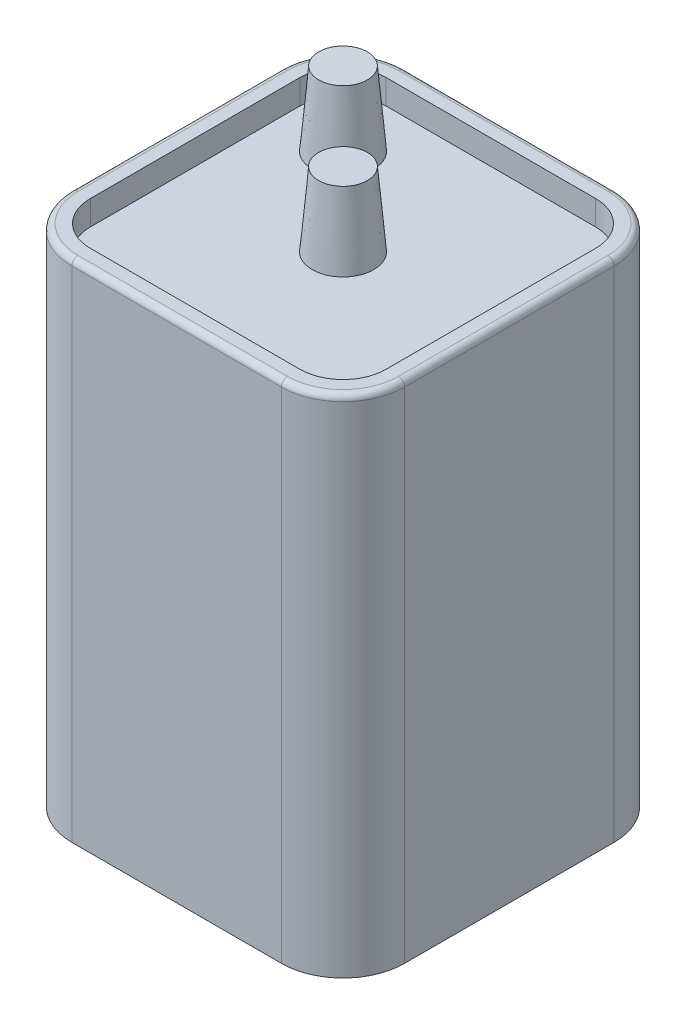
ISO-10303-21;
HEADER;
FILE_DESCRIPTION(('STEP AP214'),'2;1');
FILE_NAME('part.step','',(''),(''),'','','');
FILE_SCHEMA(('AUTOMOTIVE_DESIGN { 1 0 10303 214 1 1 1 1 }'));
ENDSEC;
DATA;
#1=APPLICATION_CONTEXT('core data for automotive mechanical design processes');
#2=APPLICATION_PROTOCOL_DEFINITION('international standard','automotive_design',2000,#1);
#3=PRODUCT_CONTEXT('',#1,'mechanical');
#4=PRODUCT('Part','Part','',(#3));
#5=PRODUCT_RELATED_PRODUCT_CATEGORY('part','',(#4));
#6=PRODUCT_DEFINITION_FORMATION('','',#4);
#7=PRODUCT_DEFINITION_CONTEXT('part definition',#1,'design');
#8=PRODUCT_DEFINITION('design','',#6,#7);
#9=PRODUCT_DEFINITION_SHAPE('','',#8);
#10=(LENGTH_UNIT() NAMED_UNIT(*) SI_UNIT(.MILLI.,.METRE.));
#11=(NAMED_UNIT(*) PLANE_ANGLE_UNIT() SI_UNIT($,.RADIAN.));
#12=(NAMED_UNIT(*) SI_UNIT($,.STERADIAN.) SOLID_ANGLE_UNIT());
#13=UNCERTAINTY_MEASURE_WITH_UNIT(LENGTH_MEASURE(1.E-05),#10,'distance_accuracy_value','');
#14=(GEOMETRIC_REPRESENTATION_CONTEXT(3) GLOBAL_UNCERTAINTY_ASSIGNED_CONTEXT((#13)) GLOBAL_UNIT_ASSIGNED_CONTEXT((#10,
#11,#12)) REPRESENTATION_CONTEXT('',''));
#15=CARTESIAN_POINT('',(0.,0.,0.));
#16=DIRECTION('',(0.,0.,1.));
#17=DIRECTION('',(1.,0.,0.));
#18=AXIS2_PLACEMENT_3D('',#15,#16,#17);
#19=CARTESIAN_POINT('',(34.29,104.14,34.29));
#20=DIRECTION('',(-1.,0.,0.));
#21=DIRECTION('',(0.,0.,1.));
#22=AXIS2_PLACEMENT_3D('',#19,#20,#21);
#23=PLANE('',#22);
#24=DIRECTION('',(0.,-1.,0.));
#25=VECTOR('',#24,1.);
#26=CARTESIAN_POINT('',(34.29,104.14,-21.59));
#27=LINE('',#26,#25);
#28=CARTESIAN_POINT('',(34.29,0.,-21.59));
#29=VERTEX_POINT('',#28);
#30=CARTESIAN_POINT('',(34.29,102.87,-21.59));
#31=VERTEX_POINT('',#30);
#32=EDGE_CURVE('E291',#29,#31,#27,.F.);
#33=ORIENTED_EDGE('',*,*,#32,.T.);
#34=DIRECTION('',(0.,0.,-1.));
#35=VECTOR('',#34,1.);
#36=CARTESIAN_POINT('',(34.29,102.87,34.29));
#37=LINE('',#36,#35);
#38=CARTESIAN_POINT('',(34.29,102.87,21.59));
#39=VERTEX_POINT('',#38);
#40=EDGE_CURVE('E314',#31,#39,#37,.F.);
#41=ORIENTED_EDGE('',*,*,#40,.T.);
#42=DIRECTION('',(0.,-1.,0.));
#43=VECTOR('',#42,1.);
#44=CARTESIAN_POINT('',(34.29,104.14,21.59));
#45=LINE('',#44,#43);
#46=CARTESIAN_POINT('',(34.29,0.,21.59));
#47=VERTEX_POINT('',#46);
#48=EDGE_CURVE('E289',#39,#47,#45,.T.);
#49=ORIENTED_EDGE('',*,*,#48,.T.);
#50=DIRECTION('',(0.,0.,-1.));
#51=VECTOR('',#50,1.);
#52=CARTESIAN_POINT('',(34.29,0.,34.29));
#53=LINE('',#52,#51);
#54=EDGE_CURVE('E245',#47,#29,#53,.T.);
#55=ORIENTED_EDGE('',*,*,#54,.T.);
#56=EDGE_LOOP('',(#33,#41,#49,#55));
#57=FACE_BOUND('',#56,.T.);
#58=ADVANCED_FACE('F40',(#57),#23,.F.);
#59=CARTESIAN_POINT('',(-34.29,104.14,-34.29));
#60=DIRECTION('',(0.,0.,1.));
#61=DIRECTION('',(1.,0.,0.));
#62=AXIS2_PLACEMENT_3D('',#59,#60,#61);
#63=PLANE('',#62);
#64=DIRECTION('',(0.,-1.,0.));
#65=VECTOR('',#64,1.);
#66=CARTESIAN_POINT('',(-21.59,104.14,-34.29));
#67=LINE('',#66,#65);
#68=CARTESIAN_POINT('',(-21.59,0.,-34.29));
#69=VERTEX_POINT('',#68);
#70=CARTESIAN_POINT('',(-21.59,102.87,-34.29));
#71=VERTEX_POINT('',#70);
#72=EDGE_CURVE('E287',#69,#71,#67,.F.);
#73=ORIENTED_EDGE('',*,*,#72,.T.);
#74=DIRECTION('',(-1.,0.,0.));
#75=VECTOR('',#74,1.);
#76=CARTESIAN_POINT('',(-34.29,102.87,-34.29));
#77=LINE('',#76,#75);
#78=CARTESIAN_POINT('',(21.59,102.87,-34.29));
#79=VERTEX_POINT('',#78);
#80=EDGE_CURVE('E11',#71,#79,#77,.F.);
#81=ORIENTED_EDGE('',*,*,#80,.T.);
#82=DIRECTION('',(0.,-1.,0.));
#83=VECTOR('',#82,1.);
#84=CARTESIAN_POINT('',(21.59,104.14,-34.29));
#85=LINE('',#84,#83);
#86=CARTESIAN_POINT('',(21.59,0.,-34.29));
#87=VERTEX_POINT('',#86);
#88=EDGE_CURVE('E285',#79,#87,#85,.T.);
#89=ORIENTED_EDGE('',*,*,#88,.T.);
#90=DIRECTION('',(-1.,0.,0.));
#91=VECTOR('',#90,1.);
#92=CARTESIAN_POINT('',(-34.29,0.,-34.29));
#93=LINE('',#92,#91);
#94=EDGE_CURVE('E259',#87,#69,#93,.T.);
#95=ORIENTED_EDGE('',*,*,#94,.T.);
#96=EDGE_LOOP('',(#73,#81,#89,#95));
#97=FACE_BOUND('',#96,.T.);
#98=ADVANCED_FACE('F401',(#97),#63,.F.);
#99=CARTESIAN_POINT('',(-34.29,104.14,34.29));
#100=DIRECTION('',(1.,0.,0.));
#101=DIRECTION('',(0.,0.,-1.));
#102=AXIS2_PLACEMENT_3D('',#99,#100,#101);
#103=PLANE('',#102);
#104=DIRECTION('',(0.,-1.,0.));
#105=VECTOR('',#104,1.);
#106=CARTESIAN_POINT('',(-34.29,104.14,21.59));
#107=LINE('',#106,#105);
#108=CARTESIAN_POINT('',(-34.29,0.,21.59));
#109=VERTEX_POINT('',#108);
#110=CARTESIAN_POINT('',(-34.29,102.87,21.59));
#111=VERTEX_POINT('',#110);
#112=EDGE_CURVE('E283',#109,#111,#107,.F.);
#113=ORIENTED_EDGE('',*,*,#112,.T.);
#114=DIRECTION('',(0.,0.,1.));
#115=VECTOR('',#114,1.);
#116=CARTESIAN_POINT('',(-34.29,102.87,34.29));
#117=LINE('',#116,#115);
#118=CARTESIAN_POINT('',(-34.29,102.87,-21.59));
#119=VERTEX_POINT('',#118);
#120=EDGE_CURVE('E64',#111,#119,#117,.F.);
#121=ORIENTED_EDGE('',*,*,#120,.T.);
#122=DIRECTION('',(0.,-1.,0.));
#123=VECTOR('',#122,1.);
#124=CARTESIAN_POINT('',(-34.29,104.14,-21.59));
#125=LINE('',#124,#123);
#126=CARTESIAN_POINT('',(-34.29,0.,-21.59));
#127=VERTEX_POINT('',#126);
#128=EDGE_CURVE('E281',#119,#127,#125,.T.);
#129=ORIENTED_EDGE('',*,*,#128,.T.);
#130=DIRECTION('',(0.,0.,1.));
#131=VECTOR('',#130,1.);
#132=CARTESIAN_POINT('',(-34.29,0.,34.29));
#133=LINE('',#132,#131);
#134=EDGE_CURVE('E262',#127,#109,#133,.T.);
#135=ORIENTED_EDGE('',*,*,#134,.T.);
#136=EDGE_LOOP('',(#113,#121,#129,#135));
#137=FACE_BOUND('',#136,.T.);
#138=ADVANCED_FACE('F359',(#137),#103,.F.);
#139=CARTESIAN_POINT('',(-34.29,104.14,34.29));
#140=DIRECTION('',(0.,0.,-1.));
#141=DIRECTION('',(-1.,0.,0.));
#142=AXIS2_PLACEMENT_3D('',#139,#140,#141);
#143=PLANE('',#142);
#144=DIRECTION('',(0.,-1.,0.));
#145=VECTOR('',#144,1.);
#146=CARTESIAN_POINT('',(21.59,104.14,34.29));
#147=LINE('',#146,#145);
#148=CARTESIAN_POINT('',(21.59,0.,34.29));
#149=VERTEX_POINT('',#148);
#150=CARTESIAN_POINT('',(21.59,102.87,34.29));
#151=VERTEX_POINT('',#150);
#152=EDGE_CURVE('E268',#149,#151,#147,.F.);
#153=ORIENTED_EDGE('',*,*,#152,.T.);
#154=DIRECTION('',(1.,0.,0.));
#155=VECTOR('',#154,1.);
#156=CARTESIAN_POINT('',(-34.29,102.87,34.29));
#157=LINE('',#156,#155);
#158=CARTESIAN_POINT('',(-21.59,102.87,34.29));
#159=VERTEX_POINT('',#158);
#160=EDGE_CURVE('E318',#151,#159,#157,.F.);
#161=ORIENTED_EDGE('',*,*,#160,.T.);
#162=DIRECTION('',(0.,-1.,0.));
#163=VECTOR('',#162,1.);
#164=CARTESIAN_POINT('',(-21.59,104.14,34.29));
#165=LINE('',#164,#163);
#166=CARTESIAN_POINT('',(-21.59,0.,34.29));
#167=VERTEX_POINT('',#166);
#168=EDGE_CURVE('E271',#159,#167,#165,.T.);
#169=ORIENTED_EDGE('',*,*,#168,.T.);
#170=DIRECTION('',(1.,0.,0.));
#171=VECTOR('',#170,1.);
#172=CARTESIAN_POINT('',(-34.29,0.,34.29));
#173=LINE('',#172,#171);
#174=EDGE_CURVE('E265',#167,#149,#173,.T.);
#175=ORIENTED_EDGE('',*,*,#174,.T.);
#176=EDGE_LOOP('',(#153,#161,#169,#175));
#177=FACE_BOUND('',#176,.T.);
#178=ADVANCED_FACE('F370',(#177),#143,.F.);
#179=CARTESIAN_POINT('',(0.,104.14,0.));
#180=DIRECTION('',(0.,-1.,0.));
#181=DIRECTION('',(0.,0.,-1.));
#182=AXIS2_PLACEMENT_3D('',#179,#180,#181);
#183=PLANE('',#182);
#184=DIRECTION('',(0.,0.,-1.));
#185=VECTOR('',#184,1.);
#186=CARTESIAN_POINT('',(33.02,104.14,0.));
#187=LINE('',#186,#185);
#188=CARTESIAN_POINT('',(33.02,104.14,21.59));
#189=VERTEX_POINT('',#188);
#190=CARTESIAN_POINT('',(33.02,104.14,-21.59));
#191=VERTEX_POINT('',#190);
#192=EDGE_CURVE('E306',#189,#191,#187,.T.);
#193=ORIENTED_EDGE('',*,*,#192,.T.);
#194=CARTESIAN_POINT('',(21.59,104.14,-21.59));
#195=DIRECTION('',(0.,-1.,0.));
#196=DIRECTION('',(0.,0.,-1.));
#197=AXIS2_PLACEMENT_3D('',#194,#195,#196);
#198=CIRCLE('',#197,11.43);
#199=CARTESIAN_POINT('',(21.59,104.14,-33.02));
#200=VERTEX_POINT('',#199);
#201=EDGE_CURVE('E308',#191,#200,#198,.F.);
#202=ORIENTED_EDGE('',*,*,#201,.T.);
#203=DIRECTION('',(-1.,0.,0.));
#204=VECTOR('',#203,1.);
#205=CARTESIAN_POINT('',(0.,104.14,-33.02));
#206=LINE('',#205,#204);
#207=CARTESIAN_POINT('',(-21.59,104.14,-33.02));
#208=VERTEX_POINT('',#207);
#209=EDGE_CURVE('E294',#200,#208,#206,.T.);
#210=ORIENTED_EDGE('',*,*,#209,.T.);
#211=CARTESIAN_POINT('',(-21.59,104.14,-21.59));
#212=DIRECTION('',(0.,-1.,0.));
#213=DIRECTION('',(0.,0.,-1.));
#214=AXIS2_PLACEMENT_3D('',#211,#212,#213);
#215=CIRCLE('',#214,11.43);
#216=CARTESIAN_POINT('',(-33.02,104.14,-21.59));
#217=VERTEX_POINT('',#216);
#218=EDGE_CURVE('E296',#208,#217,#215,.F.);
#219=ORIENTED_EDGE('',*,*,#218,.T.);
#220=DIRECTION('',(0.,0.,1.));
#221=VECTOR('',#220,1.);
#222=CARTESIAN_POINT('',(-33.02,104.14,0.));
#223=LINE('',#222,#221);
#224=CARTESIAN_POINT('',(-33.02,104.14,21.59));
#225=VERTEX_POINT('',#224);
#226=EDGE_CURVE('E298',#217,#225,#223,.T.);
#227=ORIENTED_EDGE('',*,*,#226,.T.);
#228=CARTESIAN_POINT('',(-21.59,104.14,21.59));
#229=DIRECTION('',(0.,-1.,0.));
#230=DIRECTION('',(0.,0.,-1.));
#231=AXIS2_PLACEMENT_3D('',#228,#229,#230);
#232=CIRCLE('',#231,11.43);
#233=CARTESIAN_POINT('',(-21.59,104.14,33.02));
#234=VERTEX_POINT('',#233);
#235=EDGE_CURVE('E300',#225,#234,#232,.F.);
#236=ORIENTED_EDGE('',*,*,#235,.T.);
#237=DIRECTION('',(1.,0.,0.));
#238=VECTOR('',#237,1.);
#239=CARTESIAN_POINT('',(0.,104.14,33.02));
#240=LINE('',#239,#238);
#241=CARTESIAN_POINT('',(21.59,104.14,33.02));
#242=VERTEX_POINT('',#241);
#243=EDGE_CURVE('E302',#234,#242,#240,.T.);
#244=ORIENTED_EDGE('',*,*,#243,.T.);
#245=CARTESIAN_POINT('',(21.59,104.14,21.59));
#246=DIRECTION('',(0.,-1.,0.));
#247=DIRECTION('',(0.,0.,-1.));
#248=AXIS2_PLACEMENT_3D('',#245,#246,#247);
#249=CIRCLE('',#248,11.43);
#250=EDGE_CURVE('E304',#242,#189,#249,.F.);
#251=ORIENTED_EDGE('',*,*,#250,.T.);
#252=EDGE_LOOP('',(#193,#202,#210,#219,#227,#236,#244,#251));
#253=FACE_BOUND('',#252,.T.);
#254=DIRECTION('',(0.,0.,1.));
#255=VECTOR('',#254,1.);
#256=CARTESIAN_POINT('',(-30.48,104.14,-21.59));
#257=LINE('',#256,#255);
#258=CARTESIAN_POINT('',(-30.48,104.14,-21.59));
#259=VERTEX_POINT('',#258);
#260=CARTESIAN_POINT('',(-30.48,104.14,21.59));
#261=VERTEX_POINT('',#260);
#262=EDGE_CURVE('E227',#259,#261,#257,.T.);
#263=ORIENTED_EDGE('',*,*,#262,.F.);
#264=CARTESIAN_POINT('',(-21.59,104.14,-21.59));
#265=DIRECTION('',(0.,1.,0.));
#266=DIRECTION('',(0.,0.,1.));
#267=AXIS2_PLACEMENT_3D('',#264,#265,#266);
#268=CIRCLE('',#267,8.89);
#269=CARTESIAN_POINT('',(-21.59,104.14,-30.48));
#270=VERTEX_POINT('',#269);
#271=EDGE_CURVE('E186',#270,#259,#268,.T.);
#272=ORIENTED_EDGE('',*,*,#271,.F.);
#273=DIRECTION('',(-1.,0.,0.));
#274=VECTOR('',#273,1.);
#275=CARTESIAN_POINT('',(21.59,104.14,-30.48));
#276=LINE('',#275,#274);
#277=CARTESIAN_POINT('',(21.59,104.14,-30.48));
#278=VERTEX_POINT('',#277);
#279=EDGE_CURVE('E204',#278,#270,#276,.T.);
#280=ORIENTED_EDGE('',*,*,#279,.F.);
#281=CARTESIAN_POINT('',(21.59,104.14,-21.59));
#282=DIRECTION('',(0.,1.,0.));
#283=DIRECTION('',(0.,0.,1.));
#284=AXIS2_PLACEMENT_3D('',#281,#282,#283);
#285=CIRCLE('',#284,8.89);
#286=CARTESIAN_POINT('',(30.48,104.14,-21.59));
#287=VERTEX_POINT('',#286);
#288=EDGE_CURVE('E207',#287,#278,#285,.T.);
#289=ORIENTED_EDGE('',*,*,#288,.F.);
#290=DIRECTION('',(0.,0.,-1.));
#291=VECTOR('',#290,1.);
#292=CARTESIAN_POINT('',(30.48,104.14,21.59));
#293=LINE('',#292,#291);
#294=CARTESIAN_POINT('',(30.48,104.14,21.59));
#295=VERTEX_POINT('',#294);
#296=EDGE_CURVE('E238',#295,#287,#293,.T.);
#297=ORIENTED_EDGE('',*,*,#296,.F.);
#298=CARTESIAN_POINT('',(21.59,104.14,21.59));
#299=DIRECTION('',(0.,1.,0.));
#300=DIRECTION('',(0.,0.,1.));
#301=AXIS2_PLACEMENT_3D('',#298,#299,#300);
#302=CIRCLE('',#301,8.89);
#303=CARTESIAN_POINT('',(21.59,104.14,30.48));
#304=VERTEX_POINT('',#303);
#305=EDGE_CURVE('E235',#304,#295,#302,.T.);
#306=ORIENTED_EDGE('',*,*,#305,.F.);
#307=DIRECTION('',(1.,0.,0.));
#308=VECTOR('',#307,1.);
#309=CARTESIAN_POINT('',(-21.59,104.14,30.48));
#310=LINE('',#309,#308);
#311=CARTESIAN_POINT('',(-21.59,104.14,30.48));
#312=VERTEX_POINT('',#311);
#313=EDGE_CURVE('E232',#312,#304,#310,.T.);
#314=ORIENTED_EDGE('',*,*,#313,.F.);
#315=CARTESIAN_POINT('',(-21.59,104.14,21.59));
#316=DIRECTION('',(0.,1.,0.));
#317=DIRECTION('',(0.,0.,1.));
#318=AXIS2_PLACEMENT_3D('',#315,#316,#317);
#319=CIRCLE('',#318,8.89);
#320=EDGE_CURVE('E229',#261,#312,#319,.T.);
#321=ORIENTED_EDGE('',*,*,#320,.F.);
#322=EDGE_LOOP('',(#263,#272,#280,#289,#297,#306,#314,#321));
#323=FACE_BOUND('',#322,.T.);
#324=ADVANCED_FACE('F386',(#253,#323),#183,.F.);
#325=CARTESIAN_POINT('',(0.,0.,0.));
#326=DIRECTION('',(0.,-1.,0.));
#327=DIRECTION('',(0.,0.,-1.));
#328=AXIS2_PLACEMENT_3D('',#325,#326,#327);
#329=PLANE('',#328);
#330=ORIENTED_EDGE('',*,*,#174,.F.);
#331=CARTESIAN_POINT('',(-21.59,0.,21.59));
#332=DIRECTION('',(0.,-1.,0.));
#333=DIRECTION('',(0.,0.,-1.));
#334=AXIS2_PLACEMENT_3D('',#331,#332,#333);
#335=CIRCLE('',#334,12.7);
#336=EDGE_CURVE('E279',#167,#109,#335,.T.);
#337=ORIENTED_EDGE('',*,*,#336,.T.);
#338=ORIENTED_EDGE('',*,*,#134,.F.);
#339=CARTESIAN_POINT('',(-21.59,0.,-21.59));
#340=DIRECTION('',(0.,-1.,0.));
#341=DIRECTION('',(0.,0.,-1.));
#342=AXIS2_PLACEMENT_3D('',#339,#340,#341);
#343=CIRCLE('',#342,12.7);
#344=EDGE_CURVE('E277',#127,#69,#343,.T.);
#345=ORIENTED_EDGE('',*,*,#344,.T.);
#346=ORIENTED_EDGE('',*,*,#94,.F.);
#347=CARTESIAN_POINT('',(21.59,0.,-21.59));
#348=DIRECTION('',(0.,-1.,0.));
#349=DIRECTION('',(0.,0.,-1.));
#350=AXIS2_PLACEMENT_3D('',#347,#348,#349);
#351=CIRCLE('',#350,12.7);
#352=EDGE_CURVE('E275',#87,#29,#351,.T.);
#353=ORIENTED_EDGE('',*,*,#352,.T.);
#354=ORIENTED_EDGE('',*,*,#54,.F.);
#355=CARTESIAN_POINT('',(21.59,0.,21.59));
#356=DIRECTION('',(0.,-1.,0.));
#357=DIRECTION('',(0.,0.,-1.));
#358=AXIS2_PLACEMENT_3D('',#355,#356,#357);
#359=CIRCLE('',#358,12.7);
#360=EDGE_CURVE('E273',#47,#149,#359,.T.);
#361=ORIENTED_EDGE('',*,*,#360,.T.);
#362=EDGE_LOOP('',(#330,#337,#338,#345,#346,#353,#354,#361));
#363=FACE_BOUND('',#362,.T.);
#364=ADVANCED_FACE('F364',(#363),#329,.T.);
#365=CARTESIAN_POINT('',(-21.59,104.14,21.59));
#366=DIRECTION('',(0.,-1.,0.));
#367=DIRECTION('',(0.,0.,-1.));
#368=AXIS2_PLACEMENT_3D('',#365,#366,#367);
#369=CYLINDRICAL_SURFACE('',#368,12.7);
#370=ORIENTED_EDGE('',*,*,#168,.F.);
#371=CARTESIAN_POINT('',(-21.59,102.87,21.59));
#372=DIRECTION('',(0.,-1.,0.));
#373=DIRECTION('',(0.,0.,-1.));
#374=AXIS2_PLACEMENT_3D('',#371,#372,#373);
#375=CIRCLE('',#374,12.7);
#376=EDGE_CURVE('E320',#159,#111,#375,.T.);
#377=ORIENTED_EDGE('',*,*,#376,.T.);
#378=ORIENTED_EDGE('',*,*,#112,.F.);
#379=ORIENTED_EDGE('',*,*,#336,.F.);
#380=EDGE_LOOP('',(#370,#377,#378,#379));
#381=FACE_BOUND('',#380,.T.);
#382=ADVANCED_FACE('F357',(#381),#369,.T.);
#383=CARTESIAN_POINT('',(-21.59,104.14,-21.59));
#384=DIRECTION('',(0.,-1.,0.));
#385=DIRECTION('',(0.,0.,-1.));
#386=AXIS2_PLACEMENT_3D('',#383,#384,#385);
#387=CYLINDRICAL_SURFACE('',#386,12.7);
#388=ORIENTED_EDGE('',*,*,#128,.F.);
#389=CARTESIAN_POINT('',(-21.59,102.87,-21.59));
#390=DIRECTION('',(0.,-1.,0.));
#391=DIRECTION('',(0.,0.,-1.));
#392=AXIS2_PLACEMENT_3D('',#389,#390,#391);
#393=CIRCLE('',#392,12.7);
#394=EDGE_CURVE('E49',#119,#71,#393,.T.);
#395=ORIENTED_EDGE('',*,*,#394,.T.);
#396=ORIENTED_EDGE('',*,*,#72,.F.);
#397=ORIENTED_EDGE('',*,*,#344,.F.);
#398=EDGE_LOOP('',(#388,#395,#396,#397));
#399=FACE_BOUND('',#398,.T.);
#400=ADVANCED_FACE('F432',(#399),#387,.T.);
#401=CARTESIAN_POINT('',(21.59,104.14,-21.59));
#402=DIRECTION('',(0.,-1.,0.));
#403=DIRECTION('',(0.,0.,-1.));
#404=AXIS2_PLACEMENT_3D('',#401,#402,#403);
#405=CYLINDRICAL_SURFACE('',#404,12.7);
#406=ORIENTED_EDGE('',*,*,#88,.F.);
#407=CARTESIAN_POINT('',(21.59,102.87,-21.59));
#408=DIRECTION('',(0.,-1.,0.));
#409=DIRECTION('',(0.,0.,-1.));
#410=AXIS2_PLACEMENT_3D('',#407,#408,#409);
#411=CIRCLE('',#410,12.7);
#412=EDGE_CURVE('E311',#79,#31,#411,.T.);
#413=ORIENTED_EDGE('',*,*,#412,.T.);
#414=ORIENTED_EDGE('',*,*,#32,.F.);
#415=ORIENTED_EDGE('',*,*,#352,.F.);
#416=EDGE_LOOP('',(#406,#413,#414,#415));
#417=FACE_BOUND('',#416,.T.);
#418=ADVANCED_FACE('F405',(#417),#405,.T.);
#419=CARTESIAN_POINT('',(21.59,104.14,21.59));
#420=DIRECTION('',(0.,-1.,0.));
#421=DIRECTION('',(0.,0.,-1.));
#422=AXIS2_PLACEMENT_3D('',#419,#420,#421);
#423=CYLINDRICAL_SURFACE('',#422,12.7);
#424=ORIENTED_EDGE('',*,*,#48,.F.);
#425=CARTESIAN_POINT('',(21.59,102.87,21.59));
#426=DIRECTION('',(0.,-1.,0.));
#427=DIRECTION('',(0.,0.,-1.));
#428=AXIS2_PLACEMENT_3D('',#425,#426,#427);
#429=CIRCLE('',#428,12.7);
#430=EDGE_CURVE('E316',#39,#151,#429,.T.);
#431=ORIENTED_EDGE('',*,*,#430,.T.);
#432=ORIENTED_EDGE('',*,*,#152,.F.);
#433=ORIENTED_EDGE('',*,*,#360,.F.);
#434=EDGE_LOOP('',(#424,#431,#432,#433));
#435=FACE_BOUND('',#434,.T.);
#436=ADVANCED_FACE('F373',(#435),#423,.T.);
#437=CARTESIAN_POINT('',(-21.59,99.06,-21.59));
#438=DIRECTION('',(0.,1.,0.));
#439=DIRECTION('',(0.,0.,1.));
#440=AXIS2_PLACEMENT_3D('',#437,#438,#439);
#441=CYLINDRICAL_SURFACE('',#440,8.89);
#442=ORIENTED_EDGE('',*,*,#271,.T.);
#443=DIRECTION('',(0.,1.,0.));
#444=VECTOR('',#443,1.);
#445=CARTESIAN_POINT('',(-30.48,99.06,-21.59));
#446=LINE('',#445,#444);
#447=CARTESIAN_POINT('',(-30.48,99.06,-21.59));
#448=VERTEX_POINT('',#447);
#449=EDGE_CURVE('E179',#448,#259,#446,.T.);
#450=ORIENTED_EDGE('',*,*,#449,.F.);
#451=CARTESIAN_POINT('',(-21.59,99.06,-21.59));
#452=DIRECTION('',(0.,1.,0.));
#453=DIRECTION('',(0.,0.,1.));
#454=AXIS2_PLACEMENT_3D('',#451,#452,#453);
#455=CIRCLE('',#454,8.89);
#456=CARTESIAN_POINT('',(-21.59,99.06,-30.48));
#457=VERTEX_POINT('',#456);
#458=EDGE_CURVE('E183',#457,#448,#455,.T.);
#459=ORIENTED_EDGE('',*,*,#458,.F.);
#460=DIRECTION('',(0.,1.,0.));
#461=VECTOR('',#460,1.);
#462=CARTESIAN_POINT('',(-21.59,99.06,-30.48));
#463=LINE('',#462,#461);
#464=EDGE_CURVE('E243',#457,#270,#463,.T.);
#465=ORIENTED_EDGE('',*,*,#464,.T.);
#466=EDGE_LOOP('',(#442,#450,#459,#465));
#467=FACE_BOUND('',#466,.T.);
#468=ADVANCED_FACE('F181',(#467),#441,.F.);
#469=CARTESIAN_POINT('',(21.59,99.06,-30.48));
#470=DIRECTION('',(0.,0.,-1.));
#471=DIRECTION('',(-1.,0.,0.));
#472=AXIS2_PLACEMENT_3D('',#469,#470,#471);
#473=PLANE('',#472);
#474=ORIENTED_EDGE('',*,*,#279,.T.);
#475=ORIENTED_EDGE('',*,*,#464,.F.);
#476=DIRECTION('',(-1.,0.,0.));
#477=VECTOR('',#476,1.);
#478=CARTESIAN_POINT('',(21.59,99.06,-30.48));
#479=LINE('',#478,#477);
#480=CARTESIAN_POINT('',(21.59,99.06,-30.48));
#481=VERTEX_POINT('',#480);
#482=EDGE_CURVE('E191',#481,#457,#479,.T.);
#483=ORIENTED_EDGE('',*,*,#482,.F.);
#484=DIRECTION('',(0.,1.,0.));
#485=VECTOR('',#484,1.);
#486=CARTESIAN_POINT('',(21.59,99.06,-30.48));
#487=LINE('',#486,#485);
#488=EDGE_CURVE('E246',#481,#278,#487,.T.);
#489=ORIENTED_EDGE('',*,*,#488,.T.);
#490=EDGE_LOOP('',(#474,#475,#483,#489));
#491=FACE_BOUND('',#490,.T.);
#492=ADVANCED_FACE('F440',(#491),#473,.F.);
#493=CARTESIAN_POINT('',(21.59,99.06,-21.59));
#494=DIRECTION('',(0.,1.,0.));
#495=DIRECTION('',(0.,0.,1.));
#496=AXIS2_PLACEMENT_3D('',#493,#494,#495);
#497=CYLINDRICAL_SURFACE('',#496,8.89);
#498=ORIENTED_EDGE('',*,*,#288,.T.);
#499=ORIENTED_EDGE('',*,*,#488,.F.);
#500=CARTESIAN_POINT('',(21.59,99.06,-21.59));
#501=DIRECTION('',(0.,1.,0.));
#502=DIRECTION('',(0.,0.,1.));
#503=AXIS2_PLACEMENT_3D('',#500,#501,#502);
#504=CIRCLE('',#503,8.89);
#505=CARTESIAN_POINT('',(30.48,99.06,-21.59));
#506=VERTEX_POINT('',#505);
#507=EDGE_CURVE('E223',#506,#481,#504,.T.);
#508=ORIENTED_EDGE('',*,*,#507,.F.);
#509=DIRECTION('',(0.,1.,0.));
#510=VECTOR('',#509,1.);
#511=CARTESIAN_POINT('',(30.48,99.06,-21.59));
#512=LINE('',#511,#510);
#513=EDGE_CURVE('E248',#506,#287,#512,.T.);
#514=ORIENTED_EDGE('',*,*,#513,.T.);
#515=EDGE_LOOP('',(#498,#499,#508,#514));
#516=FACE_BOUND('',#515,.T.);
#517=ADVANCED_FACE('F445',(#516),#497,.F.);
#518=CARTESIAN_POINT('',(30.48,99.06,21.59));
#519=DIRECTION('',(1.,0.,0.));
#520=DIRECTION('',(0.,0.,-1.));
#521=AXIS2_PLACEMENT_3D('',#518,#519,#520);
#522=PLANE('',#521);
#523=ORIENTED_EDGE('',*,*,#296,.T.);
#524=ORIENTED_EDGE('',*,*,#513,.F.);
#525=DIRECTION('',(0.,0.,-1.));
#526=VECTOR('',#525,1.);
#527=CARTESIAN_POINT('',(30.48,99.06,21.59));
#528=LINE('',#527,#526);
#529=CARTESIAN_POINT('',(30.48,99.06,21.59));
#530=VERTEX_POINT('',#529);
#531=EDGE_CURVE('E220',#530,#506,#528,.T.);
#532=ORIENTED_EDGE('',*,*,#531,.F.);
#533=DIRECTION('',(0.,1.,0.));
#534=VECTOR('',#533,1.);
#535=CARTESIAN_POINT('',(30.48,99.06,21.59));
#536=LINE('',#535,#534);
#537=EDGE_CURVE('E250',#530,#295,#536,.T.);
#538=ORIENTED_EDGE('',*,*,#537,.T.);
#539=EDGE_LOOP('',(#523,#524,#532,#538));
#540=FACE_BOUND('',#539,.T.);
#541=ADVANCED_FACE('F654',(#540),#522,.F.);
#542=CARTESIAN_POINT('',(21.59,99.06,21.59));
#543=DIRECTION('',(0.,1.,0.));
#544=DIRECTION('',(0.,0.,1.));
#545=AXIS2_PLACEMENT_3D('',#542,#543,#544);
#546=CYLINDRICAL_SURFACE('',#545,8.89);
#547=ORIENTED_EDGE('',*,*,#305,.T.);
#548=ORIENTED_EDGE('',*,*,#537,.F.);
#549=CARTESIAN_POINT('',(21.59,99.06,21.59));
#550=DIRECTION('',(0.,1.,0.));
#551=DIRECTION('',(0.,0.,1.));
#552=AXIS2_PLACEMENT_3D('',#549,#550,#551);
#553=CIRCLE('',#552,8.89);
#554=CARTESIAN_POINT('',(21.59,99.06,30.48));
#555=VERTEX_POINT('',#554);
#556=EDGE_CURVE('E217',#555,#530,#553,.T.);
#557=ORIENTED_EDGE('',*,*,#556,.F.);
#558=DIRECTION('',(0.,1.,0.));
#559=VECTOR('',#558,1.);
#560=CARTESIAN_POINT('',(21.59,99.06,30.48));
#561=LINE('',#560,#559);
#562=EDGE_CURVE('E252',#555,#304,#561,.T.);
#563=ORIENTED_EDGE('',*,*,#562,.T.);
#564=EDGE_LOOP('',(#547,#548,#557,#563));
#565=FACE_BOUND('',#564,.T.);
#566=ADVANCED_FACE('F644',(#565),#546,.F.);
#567=CARTESIAN_POINT('',(-21.59,99.06,30.48));
#568=DIRECTION('',(0.,0.,1.));
#569=DIRECTION('',(1.,0.,0.));
#570=AXIS2_PLACEMENT_3D('',#567,#568,#569);
#571=PLANE('',#570);
#572=ORIENTED_EDGE('',*,*,#313,.T.);
#573=ORIENTED_EDGE('',*,*,#562,.F.);
#574=DIRECTION('',(1.,0.,0.));
#575=VECTOR('',#574,1.);
#576=CARTESIAN_POINT('',(-21.59,99.06,30.48));
#577=LINE('',#576,#575);
#578=CARTESIAN_POINT('',(-21.59,99.06,30.48));
#579=VERTEX_POINT('',#578);
#580=EDGE_CURVE('E214',#579,#555,#577,.T.);
#581=ORIENTED_EDGE('',*,*,#580,.F.);
#582=DIRECTION('',(0.,1.,0.));
#583=VECTOR('',#582,1.);
#584=CARTESIAN_POINT('',(-21.59,99.06,30.48));
#585=LINE('',#584,#583);
#586=EDGE_CURVE('E254',#579,#312,#585,.T.);
#587=ORIENTED_EDGE('',*,*,#586,.T.);
#588=EDGE_LOOP('',(#572,#573,#581,#587));
#589=FACE_BOUND('',#588,.T.);
#590=ADVANCED_FACE('F635',(#589),#571,.F.);
#591=CARTESIAN_POINT('',(-21.59,99.06,21.59));
#592=DIRECTION('',(0.,1.,0.));
#593=DIRECTION('',(0.,0.,1.));
#594=AXIS2_PLACEMENT_3D('',#591,#592,#593);
#595=CYLINDRICAL_SURFACE('',#594,8.89);
#596=ORIENTED_EDGE('',*,*,#320,.T.);
#597=ORIENTED_EDGE('',*,*,#586,.F.);
#598=CARTESIAN_POINT('',(-21.59,99.06,21.59));
#599=DIRECTION('',(0.,1.,0.));
#600=DIRECTION('',(0.,0.,1.));
#601=AXIS2_PLACEMENT_3D('',#598,#599,#600);
#602=CIRCLE('',#601,8.89);
#603=CARTESIAN_POINT('',(-30.48,99.06,21.59));
#604=VERTEX_POINT('',#603);
#605=EDGE_CURVE('E199',#604,#579,#602,.T.);
#606=ORIENTED_EDGE('',*,*,#605,.F.);
#607=DIRECTION('',(0.,1.,0.));
#608=VECTOR('',#607,1.);
#609=CARTESIAN_POINT('',(-30.48,99.06,21.59));
#610=LINE('',#609,#608);
#611=EDGE_CURVE('E190',#604,#261,#610,.T.);
#612=ORIENTED_EDGE('',*,*,#611,.T.);
#613=EDGE_LOOP('',(#596,#597,#606,#612));
#614=FACE_BOUND('',#613,.T.);
#615=ADVANCED_FACE('F627',(#614),#595,.F.);
#616=CARTESIAN_POINT('',(-30.48,99.06,-21.59));
#617=DIRECTION('',(-1.,0.,0.));
#618=DIRECTION('',(0.,0.,1.));
#619=AXIS2_PLACEMENT_3D('',#616,#617,#618);
#620=PLANE('',#619);
#621=ORIENTED_EDGE('',*,*,#262,.T.);
#622=ORIENTED_EDGE('',*,*,#611,.F.);
#623=DIRECTION('',(0.,0.,1.));
#624=VECTOR('',#623,1.);
#625=CARTESIAN_POINT('',(-30.48,99.06,-21.59));
#626=LINE('',#625,#624);
#627=EDGE_CURVE('E194',#448,#604,#626,.T.);
#628=ORIENTED_EDGE('',*,*,#627,.F.);
#629=ORIENTED_EDGE('',*,*,#449,.T.);
#630=EDGE_LOOP('',(#621,#622,#628,#629));
#631=FACE_BOUND('',#630,.T.);
#632=ADVANCED_FACE('F195',(#631),#620,.F.);
#633=CARTESIAN_POINT('',(-21.59,99.06,-21.59));
#634=DIRECTION('',(0.,1.,0.));
#635=DIRECTION('',(0.,0.,1.));
#636=AXIS2_PLACEMENT_3D('',#633,#634,#635);
#637=PLANE('',#636);
#638=CARTESIAN_POINT('',(-17.9605122421382,99.06,-17.9605122421384));
#639=DIRECTION('',(0.,1.,0.));
#640=DIRECTION('',(0.,0.,1.));
#641=AXIS2_PLACEMENT_3D('',#638,#639,#640);
#642=CIRCLE('',#641,6.35);
#643=CARTESIAN_POINT('',(-17.9605122421382,99.06,-11.6105122421384));
#644=VERTEX_POINT('',#643);
#645=EDGE_CURVE('E753',#644,#644,#642,.T.);
#646=ORIENTED_EDGE('',*,*,#645,.F.);
#647=EDGE_LOOP('',(#646));
#648=FACE_BOUND('',#647,.T.);
#649=CARTESIAN_POINT('',(0.,99.06,0.));
#650=DIRECTION('',(0.,1.,0.));
#651=DIRECTION('',(0.,0.,1.));
#652=AXIS2_PLACEMENT_3D('',#649,#650,#651);
#653=CIRCLE('',#652,6.35);
#654=CARTESIAN_POINT('',(0.,99.06,6.35));
#655=VERTEX_POINT('',#654);
#656=EDGE_CURVE('E756',#655,#655,#653,.T.);
#657=ORIENTED_EDGE('',*,*,#656,.F.);
#658=EDGE_LOOP('',(#657));
#659=FACE_BOUND('',#658,.T.);
#660=ORIENTED_EDGE('',*,*,#458,.T.);
#661=ORIENTED_EDGE('',*,*,#627,.T.);
#662=ORIENTED_EDGE('',*,*,#605,.T.);
#663=ORIENTED_EDGE('',*,*,#580,.T.);
#664=ORIENTED_EDGE('',*,*,#556,.T.);
#665=ORIENTED_EDGE('',*,*,#531,.T.);
#666=ORIENTED_EDGE('',*,*,#507,.T.);
#667=ORIENTED_EDGE('',*,*,#482,.T.);
#668=EDGE_LOOP('',(#660,#661,#662,#663,#664,#665,#666,#667));
#669=FACE_BOUND('',#668,.T.);
#670=ADVANCED_FACE('F201',(#648,#659,#669),#637,.T.);
#671=CARTESIAN_POINT('',(-21.59,102.87,21.59));
#672=DIRECTION('',(0.,-1.,0.));
#673=DIRECTION('',(0.,0.,-1.));
#674=AXIS2_PLACEMENT_3D('',#671,#672,#673);
#675=TOROIDAL_SURFACE('',#674,11.43,1.27);
#676=CARTESIAN_POINT('',(-33.02,102.87,21.59));
#677=DIRECTION('',(0.,0.,-1.));
#678=DIRECTION('',(-1.,0.,0.));
#679=AXIS2_PLACEMENT_3D('',#676,#677,#678);
#680=CIRCLE('',#679,1.27);
#681=EDGE_CURVE('E339',#111,#225,#680,.T.);
#682=ORIENTED_EDGE('',*,*,#681,.F.);
#683=ORIENTED_EDGE('',*,*,#376,.F.);
#684=CARTESIAN_POINT('',(-21.59,102.87,33.02));
#685=DIRECTION('',(1.,0.,0.));
#686=DIRECTION('',(0.,0.,-1.));
#687=AXIS2_PLACEMENT_3D('',#684,#685,#686);
#688=CIRCLE('',#687,1.27);
#689=EDGE_CURVE('E44',#234,#159,#688,.T.);
#690=ORIENTED_EDGE('',*,*,#689,.F.);
#691=ORIENTED_EDGE('',*,*,#235,.F.);
#692=EDGE_LOOP('',(#682,#683,#690,#691));
#693=FACE_BOUND('',#692,.T.);
#694=ADVANCED_FACE('F42',(#693),#675,.T.);
#695=CARTESIAN_POINT('',(0.,102.87,33.02));
#696=DIRECTION('',(1.,0.,0.));
#697=DIRECTION('',(0.,0.,-1.));
#698=AXIS2_PLACEMENT_3D('',#695,#696,#697);
#699=CYLINDRICAL_SURFACE('',#698,1.27);
#700=ORIENTED_EDGE('',*,*,#689,.T.);
#701=ORIENTED_EDGE('',*,*,#160,.F.);
#702=CARTESIAN_POINT('',(21.59,102.87,33.02));
#703=DIRECTION('',(1.,0.,0.));
#704=DIRECTION('',(0.,0.,-1.));
#705=AXIS2_PLACEMENT_3D('',#702,#703,#704);
#706=CIRCLE('',#705,1.27);
#707=EDGE_CURVE('E337',#242,#151,#706,.T.);
#708=ORIENTED_EDGE('',*,*,#707,.F.);
#709=ORIENTED_EDGE('',*,*,#243,.F.);
#710=EDGE_LOOP('',(#700,#701,#708,#709));
#711=FACE_BOUND('',#710,.T.);
#712=ADVANCED_FACE('F349',(#711),#699,.T.);
#713=CARTESIAN_POINT('',(-33.02,102.87,0.));
#714=DIRECTION('',(0.,0.,1.));
#715=DIRECTION('',(1.,0.,0.));
#716=AXIS2_PLACEMENT_3D('',#713,#714,#715);
#717=CYLINDRICAL_SURFACE('',#716,1.27);
#718=ORIENTED_EDGE('',*,*,#681,.T.);
#719=ORIENTED_EDGE('',*,*,#226,.F.);
#720=CARTESIAN_POINT('',(-33.02,102.87,-21.59));
#721=DIRECTION('',(0.,0.,-1.));
#722=DIRECTION('',(-1.,0.,0.));
#723=AXIS2_PLACEMENT_3D('',#720,#721,#722);
#724=CIRCLE('',#723,1.27);
#725=EDGE_CURVE('E334',#119,#217,#724,.T.);
#726=ORIENTED_EDGE('',*,*,#725,.F.);
#727=ORIENTED_EDGE('',*,*,#120,.F.);
#728=EDGE_LOOP('',(#718,#719,#726,#727));
#729=FACE_BOUND('',#728,.T.);
#730=ADVANCED_FACE('F390',(#729),#717,.T.);
#731=CARTESIAN_POINT('',(21.59,102.87,21.59));
#732=DIRECTION('',(0.,-1.,0.));
#733=DIRECTION('',(0.,0.,-1.));
#734=AXIS2_PLACEMENT_3D('',#731,#732,#733);
#735=TOROIDAL_SURFACE('',#734,11.43,1.27);
#736=ORIENTED_EDGE('',*,*,#707,.T.);
#737=ORIENTED_EDGE('',*,*,#430,.F.);
#738=CARTESIAN_POINT('',(33.02,102.87,21.59));
#739=DIRECTION('',(0.,0.,-1.));
#740=DIRECTION('',(-1.,0.,0.));
#741=AXIS2_PLACEMENT_3D('',#738,#739,#740);
#742=CIRCLE('',#741,1.27);
#743=EDGE_CURVE('E331',#189,#39,#742,.T.);
#744=ORIENTED_EDGE('',*,*,#743,.F.);
#745=ORIENTED_EDGE('',*,*,#250,.F.);
#746=EDGE_LOOP('',(#736,#737,#744,#745));
#747=FACE_BOUND('',#746,.T.);
#748=ADVANCED_FACE('F377',(#747),#735,.T.);
#749=CARTESIAN_POINT('',(-21.59,102.87,-21.59));
#750=DIRECTION('',(0.,-1.,0.));
#751=DIRECTION('',(0.,0.,-1.));
#752=AXIS2_PLACEMENT_3D('',#749,#750,#751);
#753=TOROIDAL_SURFACE('',#752,11.43,1.27);
#754=ORIENTED_EDGE('',*,*,#725,.T.);
#755=ORIENTED_EDGE('',*,*,#218,.F.);
#756=CARTESIAN_POINT('',(-21.59,102.87,-33.02));
#757=DIRECTION('',(1.,0.,0.));
#758=DIRECTION('',(0.,0.,-1.));
#759=AXIS2_PLACEMENT_3D('',#756,#757,#758);
#760=CIRCLE('',#759,1.27);
#761=EDGE_CURVE('E328',#71,#208,#760,.T.);
#762=ORIENTED_EDGE('',*,*,#761,.F.);
#763=ORIENTED_EDGE('',*,*,#394,.F.);
#764=EDGE_LOOP('',(#754,#755,#762,#763));
#765=FACE_BOUND('',#764,.T.);
#766=ADVANCED_FACE('F392',(#765),#753,.T.);
#767=CARTESIAN_POINT('',(33.02,102.87,0.));
#768=DIRECTION('',(0.,0.,-1.));
#769=DIRECTION('',(-1.,0.,0.));
#770=AXIS2_PLACEMENT_3D('',#767,#768,#769);
#771=CYLINDRICAL_SURFACE('',#770,1.27);
#772=ORIENTED_EDGE('',*,*,#743,.T.);
#773=ORIENTED_EDGE('',*,*,#40,.F.);
#774=CARTESIAN_POINT('',(33.02,102.87,-21.59));
#775=DIRECTION('',(0.,0.,-1.));
#776=DIRECTION('',(-1.,0.,0.));
#777=AXIS2_PLACEMENT_3D('',#774,#775,#776);
#778=CIRCLE('',#777,1.27);
#779=EDGE_CURVE('E326',#191,#31,#778,.T.);
#780=ORIENTED_EDGE('',*,*,#779,.F.);
#781=ORIENTED_EDGE('',*,*,#192,.F.);
#782=EDGE_LOOP('',(#772,#773,#780,#781));
#783=FACE_BOUND('',#782,.T.);
#784=ADVANCED_FACE('F382',(#783),#771,.T.);
#785=CARTESIAN_POINT('',(0.,102.87,-33.02));
#786=DIRECTION('',(-1.,0.,0.));
#787=DIRECTION('',(0.,0.,1.));
#788=AXIS2_PLACEMENT_3D('',#785,#786,#787);
#789=CYLINDRICAL_SURFACE('',#788,1.27);
#790=ORIENTED_EDGE('',*,*,#761,.T.);
#791=ORIENTED_EDGE('',*,*,#209,.F.);
#792=CARTESIAN_POINT('',(21.59,102.87,-33.02));
#793=DIRECTION('',(1.,0.,0.));
#794=DIRECTION('',(0.,0.,-1.));
#795=AXIS2_PLACEMENT_3D('',#792,#793,#794);
#796=CIRCLE('',#795,1.27);
#797=EDGE_CURVE('E324',#79,#200,#796,.T.);
#798=ORIENTED_EDGE('',*,*,#797,.F.);
#799=ORIENTED_EDGE('',*,*,#80,.F.);
#800=EDGE_LOOP('',(#790,#791,#798,#799));
#801=FACE_BOUND('',#800,.T.);
#802=ADVANCED_FACE('F398',(#801),#789,.T.);
#803=CARTESIAN_POINT('',(21.59,102.87,-21.59));
#804=DIRECTION('',(0.,-1.,0.));
#805=DIRECTION('',(0.,0.,-1.));
#806=AXIS2_PLACEMENT_3D('',#803,#804,#805);
#807=TOROIDAL_SURFACE('',#806,11.43,1.27);
#808=ORIENTED_EDGE('',*,*,#779,.T.);
#809=ORIENTED_EDGE('',*,*,#412,.F.);
#810=ORIENTED_EDGE('',*,*,#797,.T.);
#811=ORIENTED_EDGE('',*,*,#201,.F.);
#812=EDGE_LOOP('',(#808,#809,#810,#811));
#813=FACE_BOUND('',#812,.T.);
#814=ADVANCED_FACE('F408',(#813),#807,.T.);
#815=CARTESIAN_POINT('',(0.,99.06,0.));
#816=DIRECTION('',(0.,-1.,0.));
#817=DIRECTION('',(0.,0.,1.));
#818=AXIS2_PLACEMENT_3D('',#815,#816,#817);
#819=CONICAL_SURFACE('',#818,6.35,0.0872664625997167);
#820=CARTESIAN_POINT('',(0.,114.3,0.));
#821=DIRECTION('',(0.,1.,0.));
#822=DIRECTION('',(0.,0.,1.));
#823=AXIS2_PLACEMENT_3D('',#820,#821,#822);
#824=CIRCLE('',#823,5.01667276786491);
#825=CARTESIAN_POINT('',(0.,114.3,5.01667276786491));
#826=VERTEX_POINT('',#825);
#827=EDGE_CURVE('E210',#826,#826,#824,.T.);
#828=ORIENTED_EDGE('',*,*,#827,.F.);
#829=EDGE_LOOP('',(#828));
#830=FACE_BOUND('',#829,.T.);
#831=ORIENTED_EDGE('',*,*,#656,.T.);
#832=EDGE_LOOP('',(#831));
#833=FACE_BOUND('',#832,.T.);
#834=ADVANCED_FACE('F410',(#830,#833),#819,.T.);
#835=CARTESIAN_POINT('',(0.,114.3,0.));
#836=DIRECTION('',(0.,1.,0.));
#837=DIRECTION('',(0.,0.,1.));
#838=AXIS2_PLACEMENT_3D('',#835,#836,#837);
#839=PLANE('',#838);
#840=ORIENTED_EDGE('',*,*,#827,.T.);
#841=EDGE_LOOP('',(#840));
#842=FACE_BOUND('',#841,.T.);
#843=ADVANCED_FACE('F416',(#842),#839,.T.);
#844=CARTESIAN_POINT('',(-17.9605122421382,99.06,-17.9605122421384));
#845=DIRECTION('',(0.,-1.,0.));
#846=DIRECTION('',(0.,0.,1.));
#847=AXIS2_PLACEMENT_3D('',#844,#845,#846);
#848=CONICAL_SURFACE('',#847,6.35,0.0872664625997167);
#849=CARTESIAN_POINT('',(-17.9605122421382,114.3,-17.9605122421384));
#850=DIRECTION('',(0.,1.,0.));
#851=DIRECTION('',(0.,0.,1.));
#852=AXIS2_PLACEMENT_3D('',#849,#850,#851);
#853=CIRCLE('',#852,5.01667276786491);
#854=CARTESIAN_POINT('',(-17.9605122421382,114.3,-12.9438394742735));
#855=VERTEX_POINT('',#854);
#856=EDGE_CURVE('E752',#855,#855,#853,.T.);
#857=ORIENTED_EDGE('',*,*,#856,.F.);
#858=EDGE_LOOP('',(#857));
#859=FACE_BOUND('',#858,.T.);
#860=ORIENTED_EDGE('',*,*,#645,.T.);
#861=EDGE_LOOP('',(#860));
#862=FACE_BOUND('',#861,.T.);
#863=ADVANCED_FACE('F584',(#859,#862),#848,.T.);
#864=CARTESIAN_POINT('',(-17.9605122421382,114.3,-17.9605122421384));
#865=DIRECTION('',(0.,1.,0.));
#866=DIRECTION('',(0.,0.,1.));
#867=AXIS2_PLACEMENT_3D('',#864,#865,#866);
#868=PLANE('',#867);
#869=ORIENTED_EDGE('',*,*,#856,.T.);
#870=EDGE_LOOP('',(#869));
#871=FACE_BOUND('',#870,.T.);
#872=ADVANCED_FACE('F595',(#871),#868,.T.);
#873=CLOSED_SHELL('',(#58,#98,#138,#178,#324,#364,#382,#400,#418,#436,#468,#492,#517,#541,#566,
#590,#615,#632,#670,#694,#712,#730,#748,#766,#784,#802,#814,#834,#843,#863,#872));
#874=MANIFOLD_SOLID_BREP('B2',#873);
#875=ADVANCED_BREP_SHAPE_REPRESENTATION('',(#18,#874),#14);
#876=SHAPE_DEFINITION_REPRESENTATION(#9,#875);
ENDSEC;
END-ISO-10303-21;
